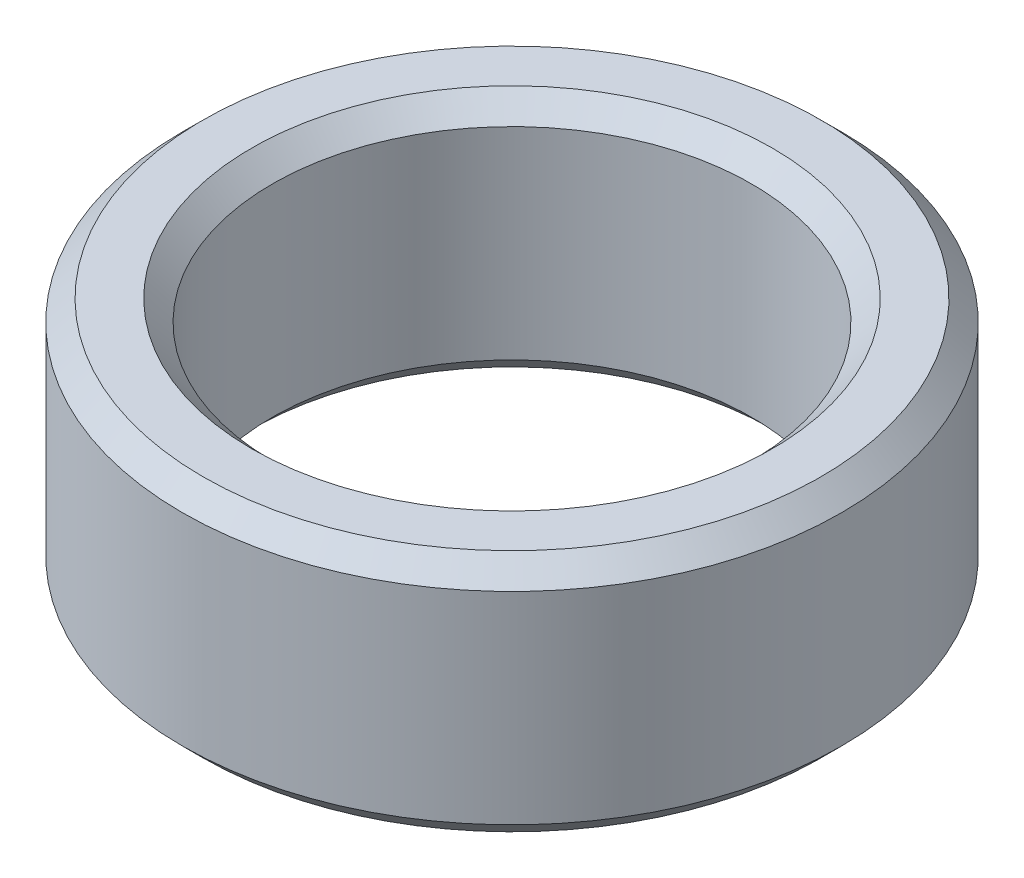
ISO-10303-21;
HEADER;
FILE_DESCRIPTION(('STEP AP214'),'2;1');
FILE_NAME('part.step','',(''),(''),'','','');
FILE_SCHEMA(('AUTOMOTIVE_DESIGN { 1 0 10303 214 1 1 1 1 }'));
ENDSEC;
DATA;
#1=APPLICATION_CONTEXT('core data for automotive mechanical design processes');
#2=APPLICATION_PROTOCOL_DEFINITION('international standard','automotive_design',2000,#1);
#3=PRODUCT_CONTEXT('',#1,'mechanical');
#4=PRODUCT('Part','Part','',(#3));
#5=PRODUCT_RELATED_PRODUCT_CATEGORY('part','',(#4));
#6=PRODUCT_DEFINITION_FORMATION('','',#4);
#7=PRODUCT_DEFINITION_CONTEXT('part definition',#1,'design');
#8=PRODUCT_DEFINITION('design','',#6,#7);
#9=PRODUCT_DEFINITION_SHAPE('','',#8);
#10=(LENGTH_UNIT() NAMED_UNIT(*) SI_UNIT(.MILLI.,.METRE.));
#11=(NAMED_UNIT(*) PLANE_ANGLE_UNIT() SI_UNIT($,.RADIAN.));
#12=(NAMED_UNIT(*) SI_UNIT($,.STERADIAN.) SOLID_ANGLE_UNIT());
#13=UNCERTAINTY_MEASURE_WITH_UNIT(LENGTH_MEASURE(1.E-05),#10,'distance_accuracy_value','');
#14=(GEOMETRIC_REPRESENTATION_CONTEXT(3) GLOBAL_UNCERTAINTY_ASSIGNED_CONTEXT((#13)) GLOBAL_UNIT_ASSIGNED_CONTEXT((#10,
#11,#12)) REPRESENTATION_CONTEXT('',''));
#15=CARTESIAN_POINT('',(0.,0.,0.));
#16=DIRECTION('',(0.,0.,1.));
#17=DIRECTION('',(1.,0.,0.));
#18=AXIS2_PLACEMENT_3D('',#15,#16,#17);
#19=CARTESIAN_POINT('',(0.,27.6922156754732,0.));
#20=DIRECTION('',(0.,-1.,0.));
#21=DIRECTION('',(0.,0.,-1.));
#22=AXIS2_PLACEMENT_3D('',#19,#20,#21);
#23=CYLINDRICAL_SURFACE('',#22,37.5);
#24=CARTESIAN_POINT('',(0.,2.35433398996892,0.));
#25=DIRECTION('',(0.,1.,0.));
#26=DIRECTION('',(0.,0.,1.));
#27=AXIS2_PLACEMENT_3D('',#24,#25,#26);
#28=CIRCLE('',#27,37.5);
#29=CARTESIAN_POINT('',(0.,2.35433398996892,37.5));
#30=VERTEX_POINT('',#29);
#31=EDGE_CURVE('E10',#30,#30,#28,.T.);
#32=ORIENTED_EDGE('',*,*,#31,.T.);
#33=EDGE_LOOP('',(#32));
#34=FACE_BOUND('',#33,.T.);
#35=CARTESIAN_POINT('',(0.,25.3378816855043,0.));
#36=DIRECTION('',(0.,1.,0.));
#37=DIRECTION('',(0.,0.,1.));
#38=AXIS2_PLACEMENT_3D('',#35,#36,#37);
#39=CIRCLE('',#38,37.5);
#40=CARTESIAN_POINT('',(0.,25.3378816855043,37.5));
#41=VERTEX_POINT('',#40);
#42=EDGE_CURVE('E50',#41,#41,#39,.F.);
#43=ORIENTED_EDGE('',*,*,#42,.T.);
#44=EDGE_LOOP('',(#43));
#45=FACE_BOUND('',#44,.T.);
#46=ADVANCED_FACE('F39',(#34,#45),#23,.T.);
#47=CARTESIAN_POINT('',(0.,27.6922156754732,0.));
#48=DIRECTION('',(0.,1.,0.));
#49=DIRECTION('',(0.,0.,1.));
#50=AXIS2_PLACEMENT_3D('',#47,#48,#49);
#51=PLANE('',#50);
#52=CARTESIAN_POINT('',(0.,27.6922156754732,0.));
#53=DIRECTION('',(0.,1.,0.));
#54=DIRECTION('',(0.,0.,1.));
#55=AXIS2_PLACEMENT_3D('',#52,#53,#54);
#56=CIRCLE('',#55,29.6178938283927);
#57=CARTESIAN_POINT('',(0.,27.6922156754732,29.6178938283927));
#58=VERTEX_POINT('',#57);
#59=EDGE_CURVE('E58',#58,#58,#56,.F.);
#60=ORIENTED_EDGE('',*,*,#59,.T.);
#61=EDGE_LOOP('',(#60));
#62=FACE_BOUND('',#61,.T.);
#63=CARTESIAN_POINT('',(0.,27.6922156754732,0.));
#64=DIRECTION('',(0.,1.,0.));
#65=DIRECTION('',(0.,0.,1.));
#66=AXIS2_PLACEMENT_3D('',#63,#64,#65);
#67=CIRCLE('',#66,35.1456660100311);
#68=CARTESIAN_POINT('',(0.,27.6922156754732,35.1456660100311));
#69=VERTEX_POINT('',#68);
#70=EDGE_CURVE('E61',#69,#69,#67,.T.);
#71=ORIENTED_EDGE('',*,*,#70,.T.);
#72=EDGE_LOOP('',(#71));
#73=FACE_BOUND('',#72,.T.);
#74=ADVANCED_FACE('F88',(#62,#73),#51,.T.);
#75=CARTESIAN_POINT('',(0.,0.,0.));
#76=DIRECTION('',(0.,1.,0.));
#77=DIRECTION('',(0.,0.,1.));
#78=AXIS2_PLACEMENT_3D('',#75,#76,#77);
#79=PLANE('',#78);
#80=CARTESIAN_POINT('',(0.,0.,0.));
#81=DIRECTION('',(0.,1.,0.));
#82=DIRECTION('',(0.,0.,1.));
#83=AXIS2_PLACEMENT_3D('',#80,#81,#82);
#84=CIRCLE('',#83,29.6178938283927);
#85=CARTESIAN_POINT('',(0.,0.,29.6178938283927));
#86=VERTEX_POINT('',#85);
#87=EDGE_CURVE('E51',#86,#86,#84,.T.);
#88=ORIENTED_EDGE('',*,*,#87,.T.);
#89=EDGE_LOOP('',(#88));
#90=FACE_BOUND('',#89,.T.);
#91=CARTESIAN_POINT('',(0.,0.,0.));
#92=DIRECTION('',(0.,1.,0.));
#93=DIRECTION('',(0.,0.,1.));
#94=AXIS2_PLACEMENT_3D('',#91,#92,#93);
#95=CIRCLE('',#94,35.1456660100311);
#96=CARTESIAN_POINT('',(0.,0.,35.1456660100311));
#97=VERTEX_POINT('',#96);
#98=EDGE_CURVE('E54',#97,#97,#95,.F.);
#99=ORIENTED_EDGE('',*,*,#98,.T.);
#100=EDGE_LOOP('',(#99));
#101=FACE_BOUND('',#100,.T.);
#102=ADVANCED_FACE('F83',(#90,#101),#79,.F.);
#103=CARTESIAN_POINT('',(0.,27.6922156754732,0.));
#104=DIRECTION('',(0.,-1.,0.));
#105=DIRECTION('',(0.,0.,-1.));
#106=AXIS2_PLACEMENT_3D('',#103,#104,#105);
#107=CYLINDRICAL_SURFACE('',#106,27.2635598384238);
#108=CARTESIAN_POINT('',(0.,25.3378816855043,0.));
#109=DIRECTION('',(0.,1.,0.));
#110=DIRECTION('',(0.,0.,1.));
#111=AXIS2_PLACEMENT_3D('',#108,#109,#110);
#112=CIRCLE('',#111,27.2635598384238);
#113=CARTESIAN_POINT('',(0.,25.3378816855043,27.2635598384238));
#114=VERTEX_POINT('',#113);
#115=EDGE_CURVE('E67',#114,#114,#112,.T.);
#116=ORIENTED_EDGE('',*,*,#115,.T.);
#117=EDGE_LOOP('',(#116));
#118=FACE_BOUND('',#117,.T.);
#119=CARTESIAN_POINT('',(0.,2.35433398996893,0.));
#120=DIRECTION('',(0.,1.,0.));
#121=DIRECTION('',(0.,0.,1.));
#122=AXIS2_PLACEMENT_3D('',#119,#120,#121);
#123=CIRCLE('',#122,27.2635598384238);
#124=CARTESIAN_POINT('',(0.,2.35433398996893,27.2635598384238));
#125=VERTEX_POINT('',#124);
#126=EDGE_CURVE('E69',#125,#125,#123,.F.);
#127=ORIENTED_EDGE('',*,*,#126,.T.);
#128=EDGE_LOOP('',(#127));
#129=FACE_BOUND('',#128,.T.);
#130=ADVANCED_FACE('F71',(#118,#129),#107,.F.);
#131=CARTESIAN_POINT('',(0.,25.3378816855043,0.));
#132=DIRECTION('',(0.,1.,0.));
#133=DIRECTION('',(0.,0.,1.));
#134=AXIS2_PLACEMENT_3D('',#131,#132,#133);
#135=CONICAL_SURFACE('',#134,27.2635598384238,0.785398163397454);
#136=ORIENTED_EDGE('',*,*,#59,.F.);
#137=EDGE_LOOP('',(#136));
#138=FACE_BOUND('',#137,.T.);
#139=ORIENTED_EDGE('',*,*,#115,.F.);
#140=EDGE_LOOP('',(#139));
#141=FACE_BOUND('',#140,.T.);
#142=ADVANCED_FACE('F77',(#138,#141),#135,.F.);
#143=CARTESIAN_POINT('',(0.,0.,0.));
#144=DIRECTION('',(0.,-1.,0.));
#145=DIRECTION('',(0.,0.,-1.));
#146=AXIS2_PLACEMENT_3D('',#143,#144,#145);
#147=CONICAL_SURFACE('',#146,29.6178938283927,0.785398163397446);
#148=ORIENTED_EDGE('',*,*,#126,.F.);
#149=EDGE_LOOP('',(#148));
#150=FACE_BOUND('',#149,.T.);
#151=ORIENTED_EDGE('',*,*,#87,.F.);
#152=EDGE_LOOP('',(#151));
#153=FACE_BOUND('',#152,.T.);
#154=ADVANCED_FACE('F73',(#150,#153),#147,.F.);
#155=CARTESIAN_POINT('',(0.,2.35433398996892,0.));
#156=DIRECTION('',(0.,1.,0.));
#157=DIRECTION('',(0.,0.,1.));
#158=AXIS2_PLACEMENT_3D('',#155,#156,#157);
#159=CONICAL_SURFACE('',#158,37.5,0.785398163397451);
#160=ORIENTED_EDGE('',*,*,#98,.F.);
#161=EDGE_LOOP('',(#160));
#162=FACE_BOUND('',#161,.T.);
#163=ORIENTED_EDGE('',*,*,#31,.F.);
#164=EDGE_LOOP('',(#163));
#165=FACE_BOUND('',#164,.T.);
#166=ADVANCED_FACE('F76',(#162,#165),#159,.T.);
#167=CARTESIAN_POINT('',(0.,27.6922156754732,0.));
#168=DIRECTION('',(0.,-1.,0.));
#169=DIRECTION('',(0.,0.,-1.));
#170=AXIS2_PLACEMENT_3D('',#167,#168,#169);
#171=CONICAL_SURFACE('',#170,35.1456660100311,0.785398163397444);
#172=ORIENTED_EDGE('',*,*,#42,.F.);
#173=EDGE_LOOP('',(#172));
#174=FACE_BOUND('',#173,.T.);
#175=ORIENTED_EDGE('',*,*,#70,.F.);
#176=EDGE_LOOP('',(#175));
#177=FACE_BOUND('',#176,.T.);
#178=ADVANCED_FACE('F45',(#174,#177),#171,.T.);
#179=CLOSED_SHELL('',(#46,#74,#102,#130,#142,#154,#166,#178));
#180=MANIFOLD_SOLID_BREP('B2',#179);
#181=ADVANCED_BREP_SHAPE_REPRESENTATION('',(#18,#180),#14);
#182=SHAPE_DEFINITION_REPRESENTATION(#9,#181);
ENDSEC;
END-ISO-10303-21;
